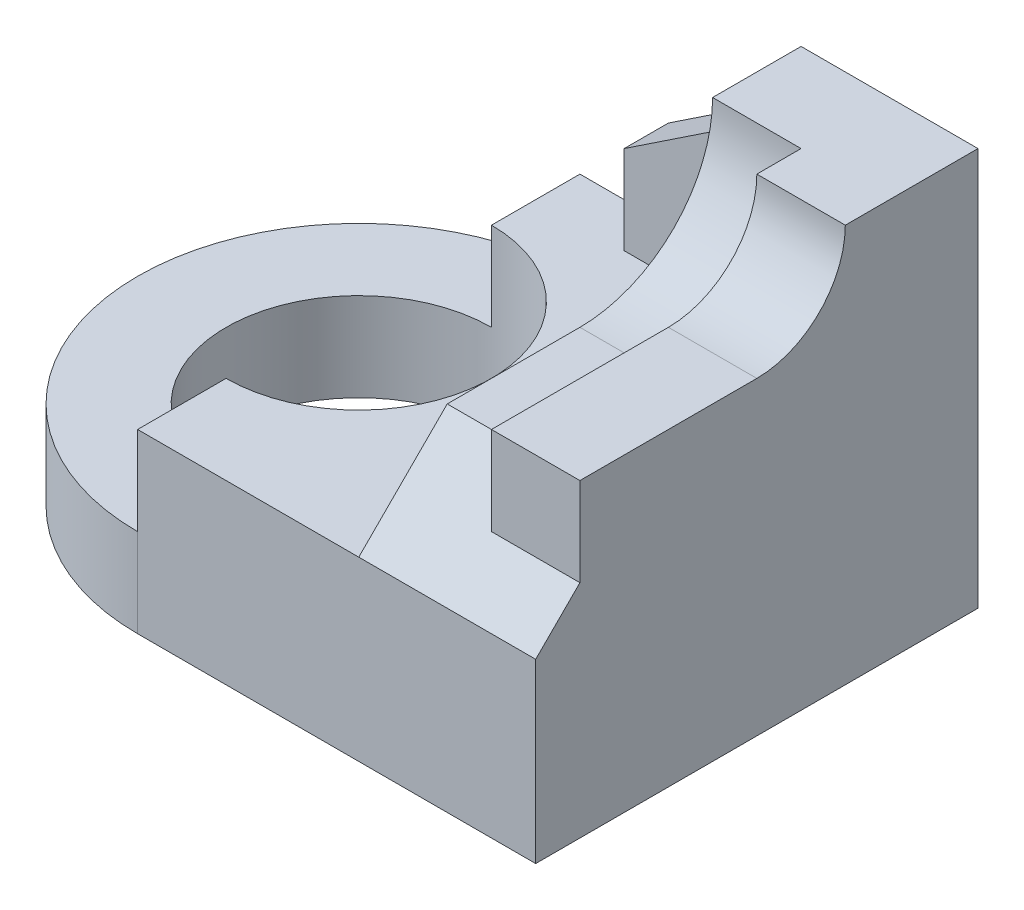
ISO-10303-21;
HEADER;
FILE_DESCRIPTION(('STEP AP214'),'2;1');
FILE_NAME('part.step','',(''),(''),'','','');
FILE_SCHEMA(('AUTOMOTIVE_DESIGN { 1 0 10303 214 1 1 1 1 }'));
ENDSEC;
DATA;
#1=APPLICATION_CONTEXT('core data for automotive mechanical design processes');
#2=APPLICATION_PROTOCOL_DEFINITION('international standard','automotive_design',2000,#1);
#3=PRODUCT_CONTEXT('',#1,'mechanical');
#4=PRODUCT('Part','Part','',(#3));
#5=PRODUCT_RELATED_PRODUCT_CATEGORY('part','',(#4));
#6=PRODUCT_DEFINITION_FORMATION('','',#4);
#7=PRODUCT_DEFINITION_CONTEXT('part definition',#1,'design');
#8=PRODUCT_DEFINITION('design','',#6,#7);
#9=PRODUCT_DEFINITION_SHAPE('','',#8);
#10=(LENGTH_UNIT() NAMED_UNIT(*) SI_UNIT(.MILLI.,.METRE.));
#11=(NAMED_UNIT(*) PLANE_ANGLE_UNIT() SI_UNIT($,.RADIAN.));
#12=(NAMED_UNIT(*) SI_UNIT($,.STERADIAN.) SOLID_ANGLE_UNIT());
#13=UNCERTAINTY_MEASURE_WITH_UNIT(LENGTH_MEASURE(1.E-05),#10,'distance_accuracy_value','');
#14=(GEOMETRIC_REPRESENTATION_CONTEXT(3) GLOBAL_UNCERTAINTY_ASSIGNED_CONTEXT((#13)) GLOBAL_UNIT_ASSIGNED_CONTEXT((#10,
#11,#12)) REPRESENTATION_CONTEXT('',''));
#15=CARTESIAN_POINT('',(0.,0.,0.));
#16=DIRECTION('',(0.,0.,1.));
#17=DIRECTION('',(1.,0.,0.));
#18=AXIS2_PLACEMENT_3D('',#15,#16,#17);
#19=CARTESIAN_POINT('',(0.,90.,0.));
#20=DIRECTION('',(0.,1.,0.));
#21=DIRECTION('',(0.,0.,1.));
#22=AXIS2_PLACEMENT_3D('',#19,#20,#21);
#23=PLANE('',#22);
#24=DIRECTION('',(-1.,0.,0.));
#25=VECTOR('',#24,1.);
#26=CARTESIAN_POINT('',(0.,90.,-70.));
#27=LINE('',#26,#25);
#28=CARTESIAN_POINT('',(0.,90.,-70.));
#29=VERTEX_POINT('',#28);
#30=CARTESIAN_POINT('',(-20.,90.,-70.));
#31=VERTEX_POINT('',#30);
#32=EDGE_CURVE('E209',#29,#31,#27,.T.);
#33=ORIENTED_EDGE('',*,*,#32,.F.);
#34=DIRECTION('',(0.,0.,-1.));
#35=VECTOR('',#34,1.);
#36=CARTESIAN_POINT('',(0.,90.,0.));
#37=LINE('',#36,#35);
#38=CARTESIAN_POINT('',(0.,90.,-100.));
#39=VERTEX_POINT('',#38);
#40=EDGE_CURVE('E285',#29,#39,#37,.T.);
#41=ORIENTED_EDGE('',*,*,#40,.T.);
#42=DIRECTION('',(-1.,0.,0.));
#43=VECTOR('',#42,1.);
#44=CARTESIAN_POINT('',(0.,90.,-100.));
#45=LINE('',#44,#43);
#46=CARTESIAN_POINT('',(-40.,90.,-100.));
#47=VERTEX_POINT('',#46);
#48=EDGE_CURVE('E287',#39,#47,#45,.T.);
#49=ORIENTED_EDGE('',*,*,#48,.T.);
#50=DIRECTION('',(0.,0.,1.));
#51=VECTOR('',#50,1.);
#52=CARTESIAN_POINT('',(-40.,90.,0.));
#53=LINE('',#52,#51);
#54=CARTESIAN_POINT('',(-40.,90.,-80.));
#55=VERTEX_POINT('',#54);
#56=EDGE_CURVE('E259',#47,#55,#53,.T.);
#57=ORIENTED_EDGE('',*,*,#56,.T.);
#58=DIRECTION('',(-1.,0.,0.));
#59=VECTOR('',#58,1.);
#60=CARTESIAN_POINT('',(-20.,90.,-80.));
#61=LINE('',#60,#59);
#62=CARTESIAN_POINT('',(-20.,90.,-80.));
#63=VERTEX_POINT('',#62);
#64=EDGE_CURVE('E241',#63,#55,#61,.T.);
#65=ORIENTED_EDGE('',*,*,#64,.F.);
#66=DIRECTION('',(0.,0.,-1.));
#67=VECTOR('',#66,1.);
#68=CARTESIAN_POINT('',(-20.,90.,-80.));
#69=LINE('',#68,#67);
#70=EDGE_CURVE('E235',#31,#63,#69,.T.);
#71=ORIENTED_EDGE('',*,*,#70,.F.);
#72=EDGE_LOOP('',(#33,#41,#49,#57,#65,#71));
#73=FACE_BOUND('',#72,.T.);
#74=ADVANCED_FACE('F33',(#73),#23,.T.);
#75=CARTESIAN_POINT('',(-90.,0.,-50.));
#76=DIRECTION('',(0.,1.,0.));
#77=DIRECTION('',(0.,0.,1.));
#78=AXIS2_PLACEMENT_3D('',#75,#76,#77);
#79=CYLINDRICAL_SURFACE('',#78,30.);
#80=CARTESIAN_POINT('',(-90.,0.,-50.));
#81=DIRECTION('',(0.,1.,0.));
#82=DIRECTION('',(0.,0.,1.));
#83=AXIS2_PLACEMENT_3D('',#80,#81,#82);
#84=CIRCLE('',#83,30.);
#85=CARTESIAN_POINT('',(-90.,0.,-20.));
#86=VERTEX_POINT('',#85);
#87=EDGE_CURVE('E273',#86,#86,#84,.T.);
#88=ORIENTED_EDGE('',*,*,#87,.F.);
#89=EDGE_LOOP('',(#88));
#90=FACE_BOUND('',#89,.T.);
#91=CARTESIAN_POINT('',(-90.,40.,-50.));
#92=DIRECTION('',(0.,1.,0.));
#93=DIRECTION('',(0.,0.,1.));
#94=AXIS2_PLACEMENT_3D('',#91,#92,#93);
#95=CIRCLE('',#94,30.);
#96=CARTESIAN_POINT('',(-90.,40.,-79.9999999999999));
#97=VERTEX_POINT('',#96);
#98=CARTESIAN_POINT('',(-90.,40.,-20.));
#99=VERTEX_POINT('',#98);
#100=EDGE_CURVE('E257',#97,#99,#95,.F.);
#101=ORIENTED_EDGE('',*,*,#100,.F.);
#102=DIRECTION('',(0.,1.,0.));
#103=VECTOR('',#102,1.);
#104=CARTESIAN_POINT('',(-90.,0.,-80.));
#105=LINE('',#104,#103);
#106=CARTESIAN_POINT('',(-90.,20.,-80.));
#107=VERTEX_POINT('',#106);
#108=EDGE_CURVE('E41',#107,#97,#105,.T.);
#109=ORIENTED_EDGE('',*,*,#108,.F.);
#110=CARTESIAN_POINT('',(-90.,20.,-50.));
#111=DIRECTION('',(0.,1.,0.));
#112=DIRECTION('',(0.,0.,1.));
#113=AXIS2_PLACEMENT_3D('',#110,#111,#112);
#114=CIRCLE('',#113,30.);
#115=CARTESIAN_POINT('',(-90.,20.,-20.));
#116=VERTEX_POINT('',#115);
#117=EDGE_CURVE('E303',#116,#107,#114,.F.);
#118=ORIENTED_EDGE('',*,*,#117,.F.);
#119=DIRECTION('',(0.,1.,0.));
#120=VECTOR('',#119,1.);
#121=CARTESIAN_POINT('',(-90.,0.,-20.));
#122=LINE('',#121,#120);
#123=EDGE_CURVE('E11',#99,#116,#122,.F.);
#124=ORIENTED_EDGE('',*,*,#123,.F.);
#125=EDGE_LOOP('',(#101,#109,#118,#124));
#126=FACE_BOUND('',#125,.T.);
#127=ADVANCED_FACE('F315',(#90,#126),#79,.F.);
#128=CARTESIAN_POINT('',(0.,90.,0.));
#129=DIRECTION('',(0.,0.,-1.));
#130=DIRECTION('',(-1.,0.,0.));
#131=AXIS2_PLACEMENT_3D('',#128,#129,#130);
#132=PLANE('',#131);
#133=DIRECTION('',(0.,-1.,0.));
#134=VECTOR('',#133,1.);
#135=CARTESIAN_POINT('',(0.,90.,0.));
#136=LINE('',#135,#134);
#137=CARTESIAN_POINT('',(0.,40.,0.));
#138=VERTEX_POINT('',#137);
#139=CARTESIAN_POINT('',(0.,0.,0.));
#140=VERTEX_POINT('',#139);
#141=EDGE_CURVE('E291',#138,#140,#136,.T.);
#142=ORIENTED_EDGE('',*,*,#141,.F.);
#143=DIRECTION('',(-1.,0.,0.));
#144=VECTOR('',#143,1.);
#145=CARTESIAN_POINT('',(-20.,40.,0.));
#146=LINE('',#145,#144);
#147=CARTESIAN_POINT('',(-40.,40.,0.));
#148=VERTEX_POINT('',#147);
#149=EDGE_CURVE('E223',#138,#148,#146,.T.);
#150=ORIENTED_EDGE('',*,*,#149,.T.);
#151=DIRECTION('',(1.,0.,0.));
#152=VECTOR('',#151,1.);
#153=CARTESIAN_POINT('',(-40.,40.,0.));
#154=LINE('',#153,#152);
#155=CARTESIAN_POINT('',(-90.,40.,0.));
#156=VERTEX_POINT('',#155);
#157=EDGE_CURVE('E252',#156,#148,#154,.T.);
#158=ORIENTED_EDGE('',*,*,#157,.F.);
#159=DIRECTION('',(0.,-1.,0.));
#160=VECTOR('',#159,1.);
#161=CARTESIAN_POINT('',(-90.,110.,0.));
#162=LINE('',#161,#160);
#163=CARTESIAN_POINT('',(-90.,20.,0.));
#164=VERTEX_POINT('',#163);
#165=EDGE_CURVE('E266',#156,#164,#162,.T.);
#166=ORIENTED_EDGE('',*,*,#165,.T.);
#167=DIRECTION('',(0.,1.,0.));
#168=VECTOR('',#167,1.);
#169=CARTESIAN_POINT('',(-90.,0.,0.));
#170=LINE('',#169,#168);
#171=CARTESIAN_POINT('',(-90.,0.,0.));
#172=VERTEX_POINT('',#171);
#173=EDGE_CURVE('E276',#172,#164,#170,.T.);
#174=ORIENTED_EDGE('',*,*,#173,.F.);
#175=DIRECTION('',(1.,0.,0.));
#176=VECTOR('',#175,1.);
#177=CARTESIAN_POINT('',(0.,0.,0.));
#178=LINE('',#177,#176);
#179=EDGE_CURVE('E288',#172,#140,#178,.T.);
#180=ORIENTED_EDGE('',*,*,#179,.T.);
#181=EDGE_LOOP('',(#142,#150,#158,#166,#174,#180));
#182=FACE_BOUND('',#181,.T.);
#183=ADVANCED_FACE('F328',(#182),#132,.F.);
#184=CARTESIAN_POINT('',(0.,90.,-100.));
#185=DIRECTION('',(0.,0.,1.));
#186=DIRECTION('',(1.,0.,0.));
#187=AXIS2_PLACEMENT_3D('',#184,#185,#186);
#188=PLANE('',#187);
#189=DIRECTION('',(-1.,0.,0.));
#190=VECTOR('',#189,1.);
#191=CARTESIAN_POINT('',(-40.,40.,-100.));
#192=LINE('',#191,#190);
#193=CARTESIAN_POINT('',(-70.,40.,-100.));
#194=VERTEX_POINT('',#193);
#195=CARTESIAN_POINT('',(-90.,40.,-100.));
#196=VERTEX_POINT('',#195);
#197=EDGE_CURVE('E247',#194,#196,#192,.T.);
#198=ORIENTED_EDGE('',*,*,#197,.F.);
#199=DIRECTION('',(0.,1.,0.));
#200=VECTOR('',#199,1.);
#201=CARTESIAN_POINT('',(-70.,60.,-100.));
#202=LINE('',#201,#200);
#203=CARTESIAN_POINT('',(-70.,60.,-100.));
#204=VERTEX_POINT('',#203);
#205=EDGE_CURVE('E184',#194,#204,#202,.T.);
#206=ORIENTED_EDGE('',*,*,#205,.T.);
#207=DIRECTION('',(0.832050294337843,0.554700196225229,0.));
#208=VECTOR('',#207,1.);
#209=CARTESIAN_POINT('',(-40.,80.,-100.));
#210=LINE('',#209,#208);
#211=CARTESIAN_POINT('',(-40.,80.,-100.));
#212=VERTEX_POINT('',#211);
#213=EDGE_CURVE('E166',#204,#212,#210,.T.);
#214=ORIENTED_EDGE('',*,*,#213,.T.);
#215=DIRECTION('',(0.,-1.,0.));
#216=VECTOR('',#215,1.);
#217=CARTESIAN_POINT('',(-40.,130.,-100.));
#218=LINE('',#217,#216);
#219=EDGE_CURVE('E255',#47,#212,#218,.T.);
#220=ORIENTED_EDGE('',*,*,#219,.F.);
#221=ORIENTED_EDGE('',*,*,#48,.F.);
#222=DIRECTION('',(0.,-1.,0.));
#223=VECTOR('',#222,1.);
#224=CARTESIAN_POINT('',(0.,90.,-100.));
#225=LINE('',#224,#223);
#226=CARTESIAN_POINT('',(0.,0.,-100.));
#227=VERTEX_POINT('',#226);
#228=EDGE_CURVE('E300',#39,#227,#225,.T.);
#229=ORIENTED_EDGE('',*,*,#228,.T.);
#230=DIRECTION('',(-1.,0.,0.));
#231=VECTOR('',#230,1.);
#232=CARTESIAN_POINT('',(0.,0.,-100.));
#233=LINE('',#232,#231);
#234=CARTESIAN_POINT('',(-90.,0.,-100.));
#235=VERTEX_POINT('',#234);
#236=EDGE_CURVE('E294',#227,#235,#233,.T.);
#237=ORIENTED_EDGE('',*,*,#236,.T.);
#238=DIRECTION('',(0.,1.,0.));
#239=VECTOR('',#238,1.);
#240=CARTESIAN_POINT('',(-90.,0.,-100.));
#241=LINE('',#240,#239);
#242=CARTESIAN_POINT('',(-90.,20.,-100.));
#243=VERTEX_POINT('',#242);
#244=EDGE_CURVE('E281',#235,#243,#241,.T.);
#245=ORIENTED_EDGE('',*,*,#244,.T.);
#246=DIRECTION('',(0.,-1.,0.));
#247=VECTOR('',#246,1.);
#248=CARTESIAN_POINT('',(-90.,110.,-100.));
#249=LINE('',#248,#247);
#250=EDGE_CURVE('E268',#196,#243,#249,.T.);
#251=ORIENTED_EDGE('',*,*,#250,.F.);
#252=EDGE_LOOP('',(#198,#206,#214,#220,#221,#229,#237,#245,#251));
#253=FACE_BOUND('',#252,.T.);
#254=ADVANCED_FACE('F339',(#253),#188,.F.);
#255=CARTESIAN_POINT('',(-90.,110.,0.));
#256=DIRECTION('',(-1.,0.,0.));
#257=DIRECTION('',(0.,0.,1.));
#258=AXIS2_PLACEMENT_3D('',#255,#256,#257);
#259=PLANE('',#258);
#260=ORIENTED_EDGE('',*,*,#165,.F.);
#261=DIRECTION('',(0.,0.,1.));
#262=VECTOR('',#261,1.);
#263=CARTESIAN_POINT('',(-90.,40.,0.));
#264=LINE('',#263,#262);
#265=EDGE_CURVE('E249',#99,#156,#264,.T.);
#266=ORIENTED_EDGE('',*,*,#265,.F.);
#267=ORIENTED_EDGE('',*,*,#123,.T.);
#268=DIRECTION('',(0.,0.,-1.));
#269=VECTOR('',#268,1.);
#270=CARTESIAN_POINT('',(-90.,20.,0.));
#271=LINE('',#270,#269);
#272=EDGE_CURVE('E263',#164,#116,#271,.T.);
#273=ORIENTED_EDGE('',*,*,#272,.F.);
#274=EDGE_LOOP('',(#260,#266,#267,#273));
#275=FACE_BOUND('',#274,.T.);
#276=ADVANCED_FACE('F322',(#275),#259,.T.);
#277=ORIENTED_EDGE('',*,*,#108,.T.);
#278=EDGE_CURVE('E250',#196,#97,#264,.T.);
#279=ORIENTED_EDGE('',*,*,#278,.F.);
#280=ORIENTED_EDGE('',*,*,#250,.T.);
#281=EDGE_CURVE('E262',#107,#243,#271,.T.);
#282=ORIENTED_EDGE('',*,*,#281,.F.);
#283=EDGE_LOOP('',(#277,#279,#280,#282));
#284=FACE_BOUND('',#283,.T.);
#285=ADVANCED_FACE('F309',(#284),#259,.T.);
#286=CARTESIAN_POINT('',(-90.,0.,-50.));
#287=DIRECTION('',(0.,1.,0.));
#288=DIRECTION('',(0.,0.,1.));
#289=AXIS2_PLACEMENT_3D('',#286,#287,#288);
#290=CYLINDRICAL_SURFACE('',#289,50.);
#291=ORIENTED_EDGE('',*,*,#173,.T.);
#292=CARTESIAN_POINT('',(-90.,20.,-50.));
#293=DIRECTION('',(0.,1.,0.));
#294=DIRECTION('',(0.,0.,1.));
#295=AXIS2_PLACEMENT_3D('',#292,#293,#294);
#296=CIRCLE('',#295,50.);
#297=EDGE_CURVE('E270',#164,#243,#296,.F.);
#298=ORIENTED_EDGE('',*,*,#297,.T.);
#299=ORIENTED_EDGE('',*,*,#244,.F.);
#300=CARTESIAN_POINT('',(-90.,0.,-50.));
#301=DIRECTION('',(0.,1.,0.));
#302=DIRECTION('',(0.,0.,1.));
#303=AXIS2_PLACEMENT_3D('',#300,#301,#302);
#304=CIRCLE('',#303,50.);
#305=EDGE_CURVE('E279',#235,#172,#304,.T.);
#306=ORIENTED_EDGE('',*,*,#305,.T.);
#307=EDGE_LOOP('',(#291,#298,#299,#306));
#308=FACE_BOUND('',#307,.T.);
#309=ADVANCED_FACE('F333',(#308),#290,.T.);
#310=CARTESIAN_POINT('',(0.,0.,0.));
#311=DIRECTION('',(0.,1.,0.));
#312=DIRECTION('',(0.,0.,1.));
#313=AXIS2_PLACEMENT_3D('',#310,#311,#312);
#314=PLANE('',#313);
#315=ORIENTED_EDGE('',*,*,#87,.T.);
#316=EDGE_LOOP('',(#315));
#317=FACE_BOUND('',#316,.T.);
#318=ORIENTED_EDGE('',*,*,#179,.F.);
#319=ORIENTED_EDGE('',*,*,#305,.F.);
#320=ORIENTED_EDGE('',*,*,#236,.F.);
#321=DIRECTION('',(0.,0.,-1.));
#322=VECTOR('',#321,1.);
#323=CARTESIAN_POINT('',(0.,0.,0.));
#324=LINE('',#323,#322);
#325=EDGE_CURVE('E284',#140,#227,#324,.T.);
#326=ORIENTED_EDGE('',*,*,#325,.F.);
#327=EDGE_LOOP('',(#318,#319,#320,#326));
#328=FACE_BOUND('',#327,.T.);
#329=ADVANCED_FACE('F336',(#317,#328),#314,.F.);
#330=CARTESIAN_POINT('',(0.,90.,0.));
#331=DIRECTION('',(-1.,0.,0.));
#332=DIRECTION('',(0.,0.,1.));
#333=AXIS2_PLACEMENT_3D('',#330,#331,#332);
#334=PLANE('',#333);
#335=ORIENTED_EDGE('',*,*,#40,.F.);
#336=CARTESIAN_POINT('',(0.,90.,-50.));
#337=DIRECTION('',(-1.,0.,0.));
#338=DIRECTION('',(0.,0.,1.));
#339=AXIS2_PLACEMENT_3D('',#336,#337,#338);
#340=CIRCLE('',#339,20.);
#341=CARTESIAN_POINT('',(0.,70.,-50.));
#342=VERTEX_POINT('',#341);
#343=EDGE_CURVE('E189',#29,#342,#340,.T.);
#344=ORIENTED_EDGE('',*,*,#343,.T.);
#345=DIRECTION('',(0.,0.,1.));
#346=VECTOR('',#345,1.);
#347=CARTESIAN_POINT('',(0.,70.,-50.));
#348=LINE('',#347,#346);
#349=CARTESIAN_POINT('',(0.,70.,-10.));
#350=VERTEX_POINT('',#349);
#351=EDGE_CURVE('E192',#342,#350,#348,.T.);
#352=ORIENTED_EDGE('',*,*,#351,.T.);
#353=DIRECTION('',(0.,-1.,0.));
#354=VECTOR('',#353,1.);
#355=CARTESIAN_POINT('',(0.,70.,-10.));
#356=LINE('',#355,#354);
#357=CARTESIAN_POINT('',(0.,49.9999999999998,-10.));
#358=VERTEX_POINT('',#357);
#359=EDGE_CURVE('E196',#350,#358,#356,.T.);
#360=ORIENTED_EDGE('',*,*,#359,.T.);
#361=DIRECTION('',(0.,-0.70710678118654,0.707106781186555));
#362=VECTOR('',#361,1.);
#363=CARTESIAN_POINT('',(0.,40.,0.));
#364=LINE('',#363,#362);
#365=EDGE_CURVE('E199',#358,#138,#364,.T.);
#366=ORIENTED_EDGE('',*,*,#365,.T.);
#367=ORIENTED_EDGE('',*,*,#141,.T.);
#368=ORIENTED_EDGE('',*,*,#325,.T.);
#369=ORIENTED_EDGE('',*,*,#228,.F.);
#370=EDGE_LOOP('',(#335,#344,#352,#360,#366,#367,#368,#369));
#371=FACE_BOUND('',#370,.T.);
#372=ADVANCED_FACE('F35',(#371),#334,.F.);
#373=CARTESIAN_POINT('',(0.,20.,0.));
#374=DIRECTION('',(0.,1.,0.));
#375=DIRECTION('',(0.,0.,1.));
#376=AXIS2_PLACEMENT_3D('',#373,#374,#375);
#377=PLANE('',#376);
#378=ORIENTED_EDGE('',*,*,#272,.T.);
#379=ORIENTED_EDGE('',*,*,#117,.T.);
#380=ORIENTED_EDGE('',*,*,#281,.T.);
#381=ORIENTED_EDGE('',*,*,#297,.F.);
#382=EDGE_LOOP('',(#378,#379,#380,#381));
#383=FACE_BOUND('',#382,.T.);
#384=ADVANCED_FACE('F331',(#383),#377,.T.);
#385=CARTESIAN_POINT('',(0.,40.,0.));
#386=DIRECTION('',(0.,1.,0.));
#387=DIRECTION('',(0.,0.,1.));
#388=AXIS2_PLACEMENT_3D('',#385,#386,#387);
#389=PLANE('',#388);
#390=DIRECTION('',(0.,0.,-1.));
#391=VECTOR('',#390,1.);
#392=CARTESIAN_POINT('',(-70.,40.,-90.));
#393=LINE('',#392,#391);
#394=CARTESIAN_POINT('',(-70.,40.,-90.));
#395=VERTEX_POINT('',#394);
#396=EDGE_CURVE('E52',#395,#194,#393,.T.);
#397=ORIENTED_EDGE('',*,*,#396,.T.);
#398=ORIENTED_EDGE('',*,*,#197,.T.);
#399=ORIENTED_EDGE('',*,*,#278,.T.);
#400=ORIENTED_EDGE('',*,*,#100,.T.);
#401=ORIENTED_EDGE('',*,*,#265,.T.);
#402=ORIENTED_EDGE('',*,*,#157,.T.);
#403=DIRECTION('',(0.,0.,-1.));
#404=VECTOR('',#403,1.);
#405=CARTESIAN_POINT('',(-40.,40.,0.));
#406=LINE('',#405,#404);
#407=CARTESIAN_POINT('',(-40.,40.,-90.));
#408=VERTEX_POINT('',#407);
#409=EDGE_CURVE('E243',#148,#408,#406,.T.);
#410=ORIENTED_EDGE('',*,*,#409,.T.);
#411=DIRECTION('',(-1.,0.,0.));
#412=VECTOR('',#411,1.);
#413=CARTESIAN_POINT('',(-70.,40.,-90.));
#414=LINE('',#413,#412);
#415=EDGE_CURVE('E48',#408,#395,#414,.T.);
#416=ORIENTED_EDGE('',*,*,#415,.T.);
#417=EDGE_LOOP('',(#397,#398,#399,#400,#401,#402,#410,#416));
#418=FACE_BOUND('',#417,.T.);
#419=ADVANCED_FACE('F318',(#418),#389,.T.);
#420=CARTESIAN_POINT('',(-40.,130.,0.));
#421=DIRECTION('',(-1.,0.,0.));
#422=DIRECTION('',(0.,0.,1.));
#423=AXIS2_PLACEMENT_3D('',#420,#421,#422);
#424=PLANE('',#423);
#425=DIRECTION('',(0.,0.,-1.));
#426=VECTOR('',#425,1.);
#427=CARTESIAN_POINT('',(-40.,80.,-90.));
#428=LINE('',#427,#426);
#429=CARTESIAN_POINT('',(-40.,80.,-90.));
#430=VERTEX_POINT('',#429);
#431=EDGE_CURVE('E170',#430,#212,#428,.T.);
#432=ORIENTED_EDGE('',*,*,#431,.F.);
#433=DIRECTION('',(0.,-1.,0.));
#434=VECTOR('',#433,1.);
#435=CARTESIAN_POINT('',(-40.,40.,-90.));
#436=LINE('',#435,#434);
#437=EDGE_CURVE('E179',#430,#408,#436,.T.);
#438=ORIENTED_EDGE('',*,*,#437,.T.);
#439=ORIENTED_EDGE('',*,*,#409,.F.);
#440=DIRECTION('',(0.,-0.707106781186544,0.707106781186551));
#441=VECTOR('',#440,1.);
#442=CARTESIAN_POINT('',(-40.,40.,0.));
#443=LINE('',#442,#441);
#444=CARTESIAN_POINT('',(-40.,60.,-20.0000000000002));
#445=VERTEX_POINT('',#444);
#446=EDGE_CURVE('E211',#445,#148,#443,.T.);
#447=ORIENTED_EDGE('',*,*,#446,.F.);
#448=DIRECTION('',(0.,0.,1.));
#449=VECTOR('',#448,1.);
#450=CARTESIAN_POINT('',(-40.,60.,-50.));
#451=LINE('',#450,#449);
#452=CARTESIAN_POINT('',(-40.,60.,-50.));
#453=VERTEX_POINT('',#452);
#454=EDGE_CURVE('E232',#453,#445,#451,.T.);
#455=ORIENTED_EDGE('',*,*,#454,.F.);
#456=CARTESIAN_POINT('',(-40.,90.,-50.));
#457=DIRECTION('',(-1.,0.,0.));
#458=DIRECTION('',(0.,0.,1.));
#459=AXIS2_PLACEMENT_3D('',#456,#457,#458);
#460=CIRCLE('',#459,30.);
#461=EDGE_CURVE('E226',#55,#453,#460,.T.);
#462=ORIENTED_EDGE('',*,*,#461,.F.);
#463=ORIENTED_EDGE('',*,*,#56,.F.);
#464=ORIENTED_EDGE('',*,*,#219,.T.);
#465=EDGE_LOOP('',(#432,#438,#439,#447,#455,#462,#463,#464));
#466=FACE_BOUND('',#465,.T.);
#467=ADVANCED_FACE('F350',(#466),#424,.T.);
#468=CARTESIAN_POINT('',(-20.,90.,-50.));
#469=DIRECTION('',(-1.,0.,0.));
#470=DIRECTION('',(0.,0.,1.));
#471=AXIS2_PLACEMENT_3D('',#468,#469,#470);
#472=CYLINDRICAL_SURFACE('',#471,30.);
#473=ORIENTED_EDGE('',*,*,#461,.T.);
#474=DIRECTION('',(-1.,0.,0.));
#475=VECTOR('',#474,1.);
#476=CARTESIAN_POINT('',(-20.,60.,-50.));
#477=LINE('',#476,#475);
#478=CARTESIAN_POINT('',(-20.,60.,-50.));
#479=VERTEX_POINT('',#478);
#480=EDGE_CURVE('E237',#479,#453,#477,.T.);
#481=ORIENTED_EDGE('',*,*,#480,.F.);
#482=CARTESIAN_POINT('',(-20.,90.,-50.));
#483=DIRECTION('',(-1.,0.,0.));
#484=DIRECTION('',(0.,0.,1.));
#485=AXIS2_PLACEMENT_3D('',#482,#483,#484);
#486=CIRCLE('',#485,30.);
#487=EDGE_CURVE('E228',#63,#479,#486,.T.);
#488=ORIENTED_EDGE('',*,*,#487,.F.);
#489=ORIENTED_EDGE('',*,*,#64,.T.);
#490=EDGE_LOOP('',(#473,#481,#488,#489));
#491=FACE_BOUND('',#490,.T.);
#492=ADVANCED_FACE('F406',(#491),#472,.F.);
#493=CARTESIAN_POINT('',(-20.,60.,-50.));
#494=DIRECTION('',(0.,-1.,0.));
#495=DIRECTION('',(0.,0.,-1.));
#496=AXIS2_PLACEMENT_3D('',#493,#494,#495);
#497=PLANE('',#496);
#498=ORIENTED_EDGE('',*,*,#454,.T.);
#499=DIRECTION('',(-1.,0.,0.));
#500=VECTOR('',#499,1.);
#501=CARTESIAN_POINT('',(-20.,60.,-20.0000000000002));
#502=LINE('',#501,#500);
#503=CARTESIAN_POINT('',(-20.,60.,-20.0000000000002));
#504=VERTEX_POINT('',#503);
#505=EDGE_CURVE('E221',#504,#445,#502,.T.);
#506=ORIENTED_EDGE('',*,*,#505,.F.);
#507=DIRECTION('',(0.,0.,1.));
#508=VECTOR('',#507,1.);
#509=CARTESIAN_POINT('',(-20.,60.,-50.));
#510=LINE('',#509,#508);
#511=EDGE_CURVE('E231',#479,#504,#510,.T.);
#512=ORIENTED_EDGE('',*,*,#511,.F.);
#513=ORIENTED_EDGE('',*,*,#480,.T.);
#514=EDGE_LOOP('',(#498,#506,#512,#513));
#515=FACE_BOUND('',#514,.T.);
#516=ADVANCED_FACE('F377',(#515),#497,.F.);
#517=CARTESIAN_POINT('',(-20.,90.,-50.));
#518=DIRECTION('',(-1.,0.,0.));
#519=DIRECTION('',(0.,0.,1.));
#520=AXIS2_PLACEMENT_3D('',#517,#518,#519);
#521=PLANE('',#520);
#522=CARTESIAN_POINT('',(-20.,90.,-50.));
#523=DIRECTION('',(-1.,0.,0.));
#524=DIRECTION('',(0.,0.,1.));
#525=AXIS2_PLACEMENT_3D('',#522,#523,#524);
#526=CIRCLE('',#525,20.);
#527=CARTESIAN_POINT('',(-20.,70.,-50.));
#528=VERTEX_POINT('',#527);
#529=EDGE_CURVE('E187',#31,#528,#526,.T.);
#530=ORIENTED_EDGE('',*,*,#529,.F.);
#531=ORIENTED_EDGE('',*,*,#70,.T.);
#532=ORIENTED_EDGE('',*,*,#487,.T.);
#533=ORIENTED_EDGE('',*,*,#511,.T.);
#534=DIRECTION('',(0.,-0.707106781186544,0.707106781186551));
#535=VECTOR('',#534,1.);
#536=CARTESIAN_POINT('',(-20.,40.,0.));
#537=LINE('',#536,#535);
#538=CARTESIAN_POINT('',(-20.,49.9999999999999,-10.));
#539=VERTEX_POINT('',#538);
#540=EDGE_CURVE('E218',#504,#539,#537,.T.);
#541=ORIENTED_EDGE('',*,*,#540,.T.);
#542=DIRECTION('',(0.,-1.,0.));
#543=VECTOR('',#542,1.);
#544=CARTESIAN_POINT('',(-20.,70.,-10.));
#545=LINE('',#544,#543);
#546=CARTESIAN_POINT('',(-20.,70.,-10.));
#547=VERTEX_POINT('',#546);
#548=EDGE_CURVE('E193',#547,#539,#545,.T.);
#549=ORIENTED_EDGE('',*,*,#548,.F.);
#550=DIRECTION('',(0.,0.,1.));
#551=VECTOR('',#550,1.);
#552=CARTESIAN_POINT('',(-20.,70.,-50.));
#553=LINE('',#552,#551);
#554=EDGE_CURVE('E205',#528,#547,#553,.T.);
#555=ORIENTED_EDGE('',*,*,#554,.F.);
#556=EDGE_LOOP('',(#530,#531,#532,#533,#541,#549,#555));
#557=FACE_BOUND('',#556,.T.);
#558=ADVANCED_FACE('F370',(#557),#521,.T.);
#559=CARTESIAN_POINT('',(-20.,40.,0.));
#560=DIRECTION('',(0.,-0.707106781186551,-0.707106781186544));
#561=DIRECTION('',(0.,0.707106781186544,-0.707106781186551));
#562=AXIS2_PLACEMENT_3D('',#559,#560,#561);
#563=PLANE('',#562);
#564=ORIENTED_EDGE('',*,*,#446,.T.);
#565=ORIENTED_EDGE('',*,*,#149,.F.);
#566=ORIENTED_EDGE('',*,*,#365,.F.);
#567=DIRECTION('',(-1.,0.,0.));
#568=VECTOR('',#567,1.);
#569=CARTESIAN_POINT('',(0.,49.9999999999998,-10.));
#570=LINE('',#569,#568);
#571=EDGE_CURVE('E212',#358,#539,#570,.T.);
#572=ORIENTED_EDGE('',*,*,#571,.T.);
#573=ORIENTED_EDGE('',*,*,#540,.F.);
#574=ORIENTED_EDGE('',*,*,#505,.T.);
#575=EDGE_LOOP('',(#564,#565,#566,#572,#573,#574));
#576=FACE_BOUND('',#575,.T.);
#577=ADVANCED_FACE('F368',(#576),#563,.F.);
#578=CARTESIAN_POINT('',(0.,90.,-50.));
#579=DIRECTION('',(-1.,0.,0.));
#580=DIRECTION('',(0.,0.,1.));
#581=AXIS2_PLACEMENT_3D('',#578,#579,#580);
#582=CYLINDRICAL_SURFACE('',#581,20.);
#583=ORIENTED_EDGE('',*,*,#529,.T.);
#584=DIRECTION('',(-1.,0.,0.));
#585=VECTOR('',#584,1.);
#586=CARTESIAN_POINT('',(0.,70.,-50.));
#587=LINE('',#586,#585);
#588=EDGE_CURVE('E202',#342,#528,#587,.T.);
#589=ORIENTED_EDGE('',*,*,#588,.F.);
#590=ORIENTED_EDGE('',*,*,#343,.F.);
#591=ORIENTED_EDGE('',*,*,#32,.T.);
#592=EDGE_LOOP('',(#583,#589,#590,#591));
#593=FACE_BOUND('',#592,.T.);
#594=ADVANCED_FACE('F359',(#593),#582,.F.);
#595=CARTESIAN_POINT('',(0.,70.,-10.));
#596=DIRECTION('',(0.,0.,-1.));
#597=DIRECTION('',(-1.,0.,0.));
#598=AXIS2_PLACEMENT_3D('',#595,#596,#597);
#599=PLANE('',#598);
#600=ORIENTED_EDGE('',*,*,#548,.T.);
#601=ORIENTED_EDGE('',*,*,#571,.F.);
#602=ORIENTED_EDGE('',*,*,#359,.F.);
#603=DIRECTION('',(-1.,0.,0.));
#604=VECTOR('',#603,1.);
#605=CARTESIAN_POINT('',(0.,70.,-10.));
#606=LINE('',#605,#604);
#607=EDGE_CURVE('E215',#350,#547,#606,.T.);
#608=ORIENTED_EDGE('',*,*,#607,.T.);
#609=EDGE_LOOP('',(#600,#601,#602,#608));
#610=FACE_BOUND('',#609,.T.);
#611=ADVANCED_FACE('F367',(#610),#599,.F.);
#612=CARTESIAN_POINT('',(0.,70.,-50.));
#613=DIRECTION('',(0.,-1.,0.));
#614=DIRECTION('',(0.,0.,-1.));
#615=AXIS2_PLACEMENT_3D('',#612,#613,#614);
#616=PLANE('',#615);
#617=ORIENTED_EDGE('',*,*,#554,.T.);
#618=ORIENTED_EDGE('',*,*,#607,.F.);
#619=ORIENTED_EDGE('',*,*,#351,.F.);
#620=ORIENTED_EDGE('',*,*,#588,.T.);
#621=EDGE_LOOP('',(#617,#618,#619,#620));
#622=FACE_BOUND('',#621,.T.);
#623=ADVANCED_FACE('F363',(#622),#616,.F.);
#624=CARTESIAN_POINT('',(-40.,80.,-90.));
#625=DIRECTION('',(-0.554700196225229,0.832050294337843,0.));
#626=DIRECTION('',(-0.832050294337843,-0.554700196225229,0.));
#627=AXIS2_PLACEMENT_3D('',#624,#625,#626);
#628=PLANE('',#627);
#629=ORIENTED_EDGE('',*,*,#213,.F.);
#630=DIRECTION('',(0.,0.,-1.));
#631=VECTOR('',#630,1.);
#632=CARTESIAN_POINT('',(-70.,60.,-90.));
#633=LINE('',#632,#631);
#634=CARTESIAN_POINT('',(-70.,60.,-90.));
#635=VERTEX_POINT('',#634);
#636=EDGE_CURVE('E159',#635,#204,#633,.T.);
#637=ORIENTED_EDGE('',*,*,#636,.F.);
#638=DIRECTION('',(0.832050294337843,0.554700196225229,0.));
#639=VECTOR('',#638,1.);
#640=CARTESIAN_POINT('',(-40.,80.,-90.));
#641=LINE('',#640,#639);
#642=EDGE_CURVE('E164',#635,#430,#641,.T.);
#643=ORIENTED_EDGE('',*,*,#642,.T.);
#644=ORIENTED_EDGE('',*,*,#431,.T.);
#645=EDGE_LOOP('',(#629,#637,#643,#644));
#646=FACE_BOUND('',#645,.T.);
#647=ADVANCED_FACE('F161',(#646),#628,.T.);
#648=CARTESIAN_POINT('',(-70.,60.,-90.));
#649=DIRECTION('',(-1.,0.,0.));
#650=DIRECTION('',(0.,-1.,0.));
#651=AXIS2_PLACEMENT_3D('',#648,#649,#650);
#652=PLANE('',#651);
#653=ORIENTED_EDGE('',*,*,#205,.F.);
#654=ORIENTED_EDGE('',*,*,#396,.F.);
#655=DIRECTION('',(0.,1.,0.));
#656=VECTOR('',#655,1.);
#657=CARTESIAN_POINT('',(-70.,60.,-90.));
#658=LINE('',#657,#656);
#659=EDGE_CURVE('E173',#395,#635,#658,.T.);
#660=ORIENTED_EDGE('',*,*,#659,.T.);
#661=ORIENTED_EDGE('',*,*,#636,.T.);
#662=EDGE_LOOP('',(#653,#654,#660,#661));
#663=FACE_BOUND('',#662,.T.);
#664=ADVANCED_FACE('F174',(#663),#652,.T.);
#665=CARTESIAN_POINT('',(0.,0.,-90.));
#666=DIRECTION('',(0.,0.,-1.));
#667=DIRECTION('',(-1.,0.,0.));
#668=AXIS2_PLACEMENT_3D('',#665,#666,#667);
#669=PLANE('',#668);
#670=ORIENTED_EDGE('',*,*,#437,.F.);
#671=ORIENTED_EDGE('',*,*,#642,.F.);
#672=ORIENTED_EDGE('',*,*,#659,.F.);
#673=ORIENTED_EDGE('',*,*,#415,.F.);
#674=EDGE_LOOP('',(#670,#671,#672,#673));
#675=FACE_BOUND('',#674,.T.);
#676=ADVANCED_FACE('F178',(#675),#669,.F.);
#677=CLOSED_SHELL('',(#74,#127,#183,#254,#276,#285,#309,#329,#372,#384,#419,#467,#492,#516,#558,
#577,#594,#611,#623,#647,#664,#676));
#678=MANIFOLD_SOLID_BREP('B2',#677);
#679=ADVANCED_BREP_SHAPE_REPRESENTATION('',(#18,#678),#14);
#680=SHAPE_DEFINITION_REPRESENTATION(#9,#679);
ENDSEC;
END-ISO-10303-21;
